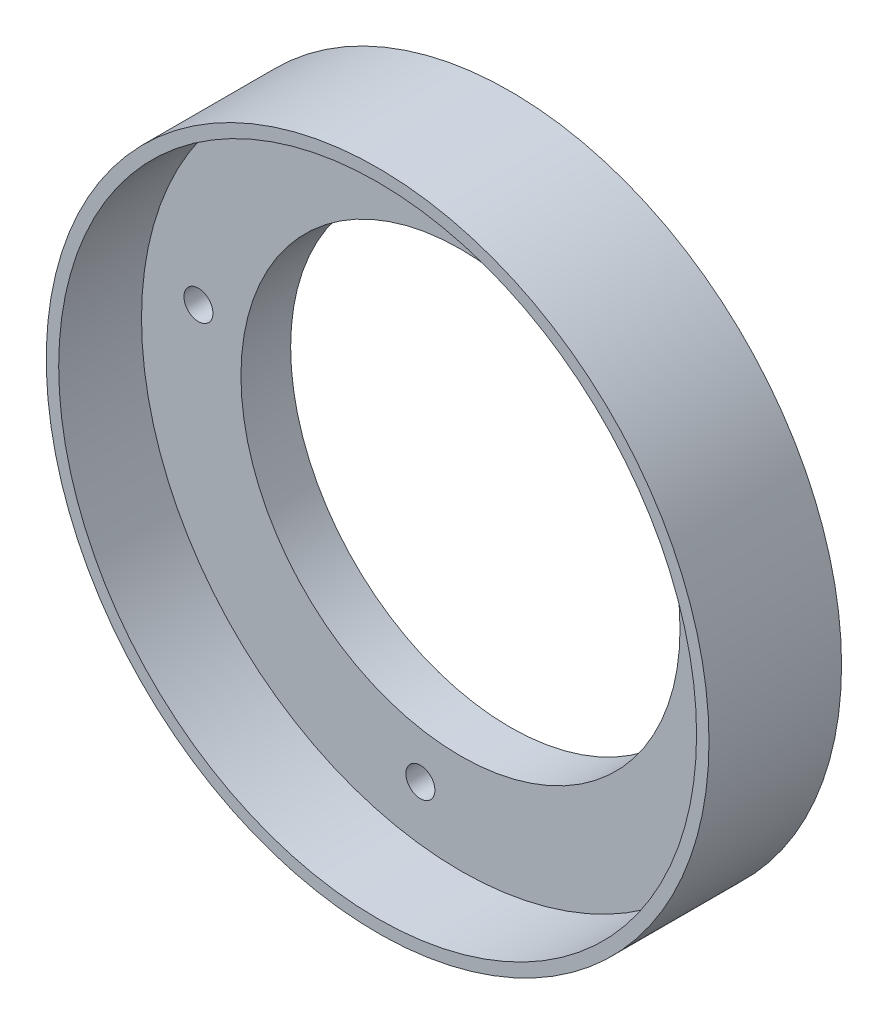
ISO-10303-21;
HEADER;
FILE_DESCRIPTION(('STEP AP214'),'2;1');
FILE_NAME('part.step','',(''),(''),'','','');
FILE_SCHEMA(('AUTOMOTIVE_DESIGN { 1 0 10303 214 1 1 1 1 }'));
ENDSEC;
DATA;
#1=APPLICATION_CONTEXT('core data for automotive mechanical design processes');
#2=APPLICATION_PROTOCOL_DEFINITION('international standard','automotive_design',2000,#1);
#3=PRODUCT_CONTEXT('',#1,'mechanical');
#4=PRODUCT('Part','Part','',(#3));
#5=PRODUCT_RELATED_PRODUCT_CATEGORY('part','',(#4));
#6=PRODUCT_DEFINITION_FORMATION('','',#4);
#7=PRODUCT_DEFINITION_CONTEXT('part definition',#1,'design');
#8=PRODUCT_DEFINITION('design','',#6,#7);
#9=PRODUCT_DEFINITION_SHAPE('','',#8);
#10=(LENGTH_UNIT() NAMED_UNIT(*) SI_UNIT(.MILLI.,.METRE.));
#11=(NAMED_UNIT(*) PLANE_ANGLE_UNIT() SI_UNIT($,.RADIAN.));
#12=(NAMED_UNIT(*) SI_UNIT($,.STERADIAN.) SOLID_ANGLE_UNIT());
#13=UNCERTAINTY_MEASURE_WITH_UNIT(LENGTH_MEASURE(1.E-05),#10,'distance_accuracy_value','');
#14=(GEOMETRIC_REPRESENTATION_CONTEXT(3) GLOBAL_UNCERTAINTY_ASSIGNED_CONTEXT((#13)) GLOBAL_UNIT_ASSIGNED_CONTEXT((#10,
#11,#12)) REPRESENTATION_CONTEXT('',''));
#15=CARTESIAN_POINT('',(0.,0.,0.));
#16=DIRECTION('',(0.,0.,1.));
#17=DIRECTION('',(1.,0.,0.));
#18=AXIS2_PLACEMENT_3D('',#15,#16,#17);
#19=CARTESIAN_POINT('',(0.,0.,6.));
#20=DIRECTION('',(0.,0.,1.));
#21=DIRECTION('',(1.,0.,0.));
#22=AXIS2_PLACEMENT_3D('',#19,#20,#21);
#23=PLANE('',#22);
#24=CARTESIAN_POINT('',(0.,0.,6.));
#25=DIRECTION('',(0.,0.,1.));
#26=DIRECTION('',(1.,0.,0.));
#27=AXIS2_PLACEMENT_3D('',#24,#25,#26);
#28=CIRCLE('',#27,26.5);
#29=CARTESIAN_POINT('',(26.5,0.,6.));
#30=VERTEX_POINT('',#29);
#31=EDGE_CURVE('E50',#30,#30,#28,.T.);
#32=ORIENTED_EDGE('',*,*,#31,.F.);
#33=EDGE_LOOP('',(#32));
#34=FACE_BOUND('',#33,.T.);
#35=CARTESIAN_POINT('',(-4.83944761944254,-31.6319418742933,6.));
#36=DIRECTION('',(0.,0.,1.));
#37=DIRECTION('',(1.,0.,0.));
#38=AXIS2_PLACEMENT_3D('',#35,#36,#37);
#39=CIRCLE('',#38,1.75);
#40=CARTESIAN_POINT('',(-3.08944761944254,-31.6319418742933,6.));
#41=VERTEX_POINT('',#40);
#42=EDGE_CURVE('E62',#41,#41,#39,.T.);
#43=ORIENTED_EDGE('',*,*,#42,.F.);
#44=EDGE_LOOP('',(#43));
#45=FACE_BOUND('',#44,.T.);
#46=CARTESIAN_POINT('',(31.6319418742934,-4.83944761944242,6.));
#47=DIRECTION('',(0.,0.,1.));
#48=DIRECTION('',(1.,0.,0.));
#49=AXIS2_PLACEMENT_3D('',#46,#47,#48);
#50=CIRCLE('',#49,1.75);
#51=CARTESIAN_POINT('',(33.3819418742934,-4.83944761944242,6.));
#52=VERTEX_POINT('',#51);
#53=EDGE_CURVE('E71',#52,#52,#50,.T.);
#54=ORIENTED_EDGE('',*,*,#53,.F.);
#55=EDGE_LOOP('',(#54));
#56=FACE_BOUND('',#55,.T.);
#57=CARTESIAN_POINT('',(4.83944761944254,31.6319418742933,6.));
#58=DIRECTION('',(0.,0.,1.));
#59=DIRECTION('',(1.,0.,0.));
#60=AXIS2_PLACEMENT_3D('',#57,#58,#59);
#61=CIRCLE('',#60,1.75);
#62=CARTESIAN_POINT('',(6.58944761944254,31.6319418742933,6.));
#63=VERTEX_POINT('',#62);
#64=EDGE_CURVE('E79',#63,#63,#61,.T.);
#65=ORIENTED_EDGE('',*,*,#64,.F.);
#66=EDGE_LOOP('',(#65));
#67=FACE_BOUND('',#66,.T.);
#68=CARTESIAN_POINT('',(-31.6319418742934,4.83944761944242,6.));
#69=DIRECTION('',(0.,0.,1.));
#70=DIRECTION('',(1.,0.,0.));
#71=AXIS2_PLACEMENT_3D('',#68,#69,#70);
#72=CIRCLE('',#71,1.75);
#73=CARTESIAN_POINT('',(-29.8819418742933,4.83944761944242,6.));
#74=VERTEX_POINT('',#73);
#75=EDGE_CURVE('E87',#74,#74,#72,.T.);
#76=ORIENTED_EDGE('',*,*,#75,.F.);
#77=EDGE_LOOP('',(#76));
#78=FACE_BOUND('',#77,.T.);
#79=CARTESIAN_POINT('',(0.,0.,6.));
#80=DIRECTION('',(0.,0.,1.));
#81=DIRECTION('',(1.,0.,0.));
#82=AXIS2_PLACEMENT_3D('',#79,#80,#81);
#83=CIRCLE('',#82,38.5);
#84=CARTESIAN_POINT('',(38.5,0.,6.));
#85=VERTEX_POINT('',#84);
#86=EDGE_CURVE('E10',#85,#85,#83,.F.);
#87=ORIENTED_EDGE('',*,*,#86,.F.);
#88=EDGE_LOOP('',(#87));
#89=FACE_BOUND('',#88,.T.);
#90=ADVANCED_FACE('F37',(#34,#45,#56,#67,#78,#89),#23,.T.);
#91=CARTESIAN_POINT('',(0.,0.,0.));
#92=DIRECTION('',(0.,0.,1.));
#93=DIRECTION('',(1.,0.,0.));
#94=AXIS2_PLACEMENT_3D('',#91,#92,#93);
#95=PLANE('',#94);
#96=CARTESIAN_POINT('',(-31.6319418742934,4.83944761944242,0.));
#97=DIRECTION('',(0.,0.,1.));
#98=DIRECTION('',(1.,0.,0.));
#99=AXIS2_PLACEMENT_3D('',#96,#97,#98);
#100=CIRCLE('',#99,1.75);
#101=CARTESIAN_POINT('',(-29.8819418742933,4.83944761944242,0.));
#102=VERTEX_POINT('',#101);
#103=EDGE_CURVE('E60',#102,#102,#100,.T.);
#104=ORIENTED_EDGE('',*,*,#103,.T.);
#105=EDGE_LOOP('',(#104));
#106=FACE_BOUND('',#105,.T.);
#107=CARTESIAN_POINT('',(4.83944761944254,31.6319418742933,0.));
#108=DIRECTION('',(0.,0.,1.));
#109=DIRECTION('',(1.,0.,0.));
#110=AXIS2_PLACEMENT_3D('',#107,#108,#109);
#111=CIRCLE('',#110,1.75);
#112=CARTESIAN_POINT('',(6.58944761944254,31.6319418742933,0.));
#113=VERTEX_POINT('',#112);
#114=EDGE_CURVE('E83',#113,#113,#111,.T.);
#115=ORIENTED_EDGE('',*,*,#114,.T.);
#116=EDGE_LOOP('',(#115));
#117=FACE_BOUND('',#116,.T.);
#118=CARTESIAN_POINT('',(31.6319418742934,-4.83944761944242,0.));
#119=DIRECTION('',(0.,0.,1.));
#120=DIRECTION('',(1.,0.,0.));
#121=AXIS2_PLACEMENT_3D('',#118,#119,#120);
#122=CIRCLE('',#121,1.75);
#123=CARTESIAN_POINT('',(33.3819418742934,-4.83944761944242,0.));
#124=VERTEX_POINT('',#123);
#125=EDGE_CURVE('E75',#124,#124,#122,.T.);
#126=ORIENTED_EDGE('',*,*,#125,.T.);
#127=EDGE_LOOP('',(#126));
#128=FACE_BOUND('',#127,.T.);
#129=CARTESIAN_POINT('',(-4.83944761944254,-31.6319418742933,0.));
#130=DIRECTION('',(0.,0.,1.));
#131=DIRECTION('',(1.,0.,0.));
#132=AXIS2_PLACEMENT_3D('',#129,#130,#131);
#133=CIRCLE('',#132,1.75);
#134=CARTESIAN_POINT('',(-3.08944761944254,-31.6319418742933,0.));
#135=VERTEX_POINT('',#134);
#136=EDGE_CURVE('E66',#135,#135,#133,.T.);
#137=ORIENTED_EDGE('',*,*,#136,.T.);
#138=EDGE_LOOP('',(#137));
#139=FACE_BOUND('',#138,.T.);
#140=CARTESIAN_POINT('',(0.,0.,0.));
#141=DIRECTION('',(0.,0.,1.));
#142=DIRECTION('',(1.,0.,0.));
#143=AXIS2_PLACEMENT_3D('',#140,#141,#142);
#144=CIRCLE('',#143,40.);
#145=CARTESIAN_POINT('',(40.,0.,0.));
#146=VERTEX_POINT('',#145);
#147=EDGE_CURVE('E45',#146,#146,#144,.T.);
#148=ORIENTED_EDGE('',*,*,#147,.F.);
#149=EDGE_LOOP('',(#148));
#150=FACE_BOUND('',#149,.T.);
#151=CARTESIAN_POINT('',(0.,0.,0.));
#152=DIRECTION('',(0.,0.,1.));
#153=DIRECTION('',(1.,0.,0.));
#154=AXIS2_PLACEMENT_3D('',#151,#152,#153);
#155=CIRCLE('',#154,26.5);
#156=CARTESIAN_POINT('',(26.5,0.,0.));
#157=VERTEX_POINT('',#156);
#158=EDGE_CURVE('E55',#157,#157,#155,.T.);
#159=ORIENTED_EDGE('',*,*,#158,.T.);
#160=EDGE_LOOP('',(#159));
#161=FACE_BOUND('',#160,.T.);
#162=ADVANCED_FACE('F118',(#106,#117,#128,#139,#150,#161),#95,.F.);
#163=CARTESIAN_POINT('',(0.,0.,6.));
#164=DIRECTION('',(0.,0.,-1.));
#165=DIRECTION('',(-1.,0.,0.));
#166=AXIS2_PLACEMENT_3D('',#163,#164,#165);
#167=CYLINDRICAL_SURFACE('',#166,40.);
#168=ORIENTED_EDGE('',*,*,#147,.T.);
#169=EDGE_LOOP('',(#168));
#170=FACE_BOUND('',#169,.T.);
#171=CARTESIAN_POINT('',(0.,0.,16.));
#172=DIRECTION('',(0.,0.,1.));
#173=DIRECTION('',(1.,0.,0.));
#174=AXIS2_PLACEMENT_3D('',#171,#172,#173);
#175=CIRCLE('',#174,40.);
#176=CARTESIAN_POINT('',(40.,0.,16.));
#177=VERTEX_POINT('',#176);
#178=EDGE_CURVE('E67',#177,#177,#175,.T.);
#179=ORIENTED_EDGE('',*,*,#178,.F.);
#180=EDGE_LOOP('',(#179));
#181=FACE_BOUND('',#180,.T.);
#182=ADVANCED_FACE('F39',(#170,#181),#167,.T.);
#183=CARTESIAN_POINT('',(0.,0.,6.));
#184=DIRECTION('',(0.,0.,-1.));
#185=DIRECTION('',(-1.,0.,0.));
#186=AXIS2_PLACEMENT_3D('',#183,#184,#185);
#187=CYLINDRICAL_SURFACE('',#186,26.5);
#188=ORIENTED_EDGE('',*,*,#31,.T.);
#189=EDGE_LOOP('',(#188));
#190=FACE_BOUND('',#189,.T.);
#191=ORIENTED_EDGE('',*,*,#158,.F.);
#192=EDGE_LOOP('',(#191));
#193=FACE_BOUND('',#192,.T.);
#194=ADVANCED_FACE('F128',(#190,#193),#187,.F.);
#195=CARTESIAN_POINT('',(-4.83944761944254,-31.6319418742933,0.));
#196=DIRECTION('',(0.,0.,1.));
#197=DIRECTION('',(1.,0.,0.));
#198=AXIS2_PLACEMENT_3D('',#195,#196,#197);
#199=CYLINDRICAL_SURFACE('',#198,1.75);
#200=ORIENTED_EDGE('',*,*,#136,.F.);
#201=EDGE_LOOP('',(#200));
#202=FACE_BOUND('',#201,.T.);
#203=ORIENTED_EDGE('',*,*,#42,.T.);
#204=EDGE_LOOP('',(#203));
#205=FACE_BOUND('',#204,.T.);
#206=ADVANCED_FACE('F131',(#202,#205),#199,.F.);
#207=CARTESIAN_POINT('',(31.6319418742934,-4.83944761944242,0.));
#208=DIRECTION('',(0.,0.,1.));
#209=DIRECTION('',(1.,0.,0.));
#210=AXIS2_PLACEMENT_3D('',#207,#208,#209);
#211=CYLINDRICAL_SURFACE('',#210,1.75);
#212=ORIENTED_EDGE('',*,*,#125,.F.);
#213=EDGE_LOOP('',(#212));
#214=FACE_BOUND('',#213,.T.);
#215=ORIENTED_EDGE('',*,*,#53,.T.);
#216=EDGE_LOOP('',(#215));
#217=FACE_BOUND('',#216,.T.);
#218=ADVANCED_FACE('F135',(#214,#217),#211,.F.);
#219=CARTESIAN_POINT('',(4.83944761944254,31.6319418742933,0.));
#220=DIRECTION('',(0.,0.,1.));
#221=DIRECTION('',(1.,0.,0.));
#222=AXIS2_PLACEMENT_3D('',#219,#220,#221);
#223=CYLINDRICAL_SURFACE('',#222,1.75);
#224=ORIENTED_EDGE('',*,*,#114,.F.);
#225=EDGE_LOOP('',(#224));
#226=FACE_BOUND('',#225,.T.);
#227=ORIENTED_EDGE('',*,*,#64,.T.);
#228=EDGE_LOOP('',(#227));
#229=FACE_BOUND('',#228,.T.);
#230=ADVANCED_FACE('F114',(#226,#229),#223,.F.);
#231=CARTESIAN_POINT('',(-31.6319418742934,4.83944761944242,0.));
#232=DIRECTION('',(0.,0.,1.));
#233=DIRECTION('',(1.,0.,0.));
#234=AXIS2_PLACEMENT_3D('',#231,#232,#233);
#235=CYLINDRICAL_SURFACE('',#234,1.75);
#236=ORIENTED_EDGE('',*,*,#103,.F.);
#237=EDGE_LOOP('',(#236));
#238=FACE_BOUND('',#237,.T.);
#239=ORIENTED_EDGE('',*,*,#75,.T.);
#240=EDGE_LOOP('',(#239));
#241=FACE_BOUND('',#240,.T.);
#242=ADVANCED_FACE('F106',(#238,#241),#235,.F.);
#243=CARTESIAN_POINT('',(0.,0.,16.));
#244=DIRECTION('',(0.,0.,1.));
#245=DIRECTION('',(1.,0.,0.));
#246=AXIS2_PLACEMENT_3D('',#243,#244,#245);
#247=PLANE('',#246);
#248=ORIENTED_EDGE('',*,*,#178,.T.);
#249=EDGE_LOOP('',(#248));
#250=FACE_BOUND('',#249,.T.);
#251=CARTESIAN_POINT('',(0.,0.,16.));
#252=DIRECTION('',(0.,0.,1.));
#253=DIRECTION('',(1.,0.,0.));
#254=AXIS2_PLACEMENT_3D('',#251,#252,#253);
#255=CIRCLE('',#254,38.5);
#256=CARTESIAN_POINT('',(38.5,0.,16.));
#257=VERTEX_POINT('',#256);
#258=EDGE_CURVE('E97',#257,#257,#255,.T.);
#259=ORIENTED_EDGE('',*,*,#258,.F.);
#260=EDGE_LOOP('',(#259));
#261=FACE_BOUND('',#260,.T.);
#262=ADVANCED_FACE('F104',(#250,#261),#247,.T.);
#263=CARTESIAN_POINT('',(0.,0.,16.));
#264=DIRECTION('',(0.,0.,-1.));
#265=DIRECTION('',(-1.,0.,0.));
#266=AXIS2_PLACEMENT_3D('',#263,#264,#265);
#267=CYLINDRICAL_SURFACE('',#266,38.5);
#268=ORIENTED_EDGE('',*,*,#258,.T.);
#269=EDGE_LOOP('',(#268));
#270=FACE_BOUND('',#269,.T.);
#271=ORIENTED_EDGE('',*,*,#86,.T.);
#272=EDGE_LOOP('',(#271));
#273=FACE_BOUND('',#272,.T.);
#274=ADVANCED_FACE('F102',(#270,#273),#267,.F.);
#275=CLOSED_SHELL('',(#90,#162,#182,#194,#206,#218,#230,#242,#262,#274));
#276=MANIFOLD_SOLID_BREP('B2',#275);
#277=ADVANCED_BREP_SHAPE_REPRESENTATION('',(#18,#276),#14);
#278=SHAPE_DEFINITION_REPRESENTATION(#9,#277);
ENDSEC;
END-ISO-10303-21;
